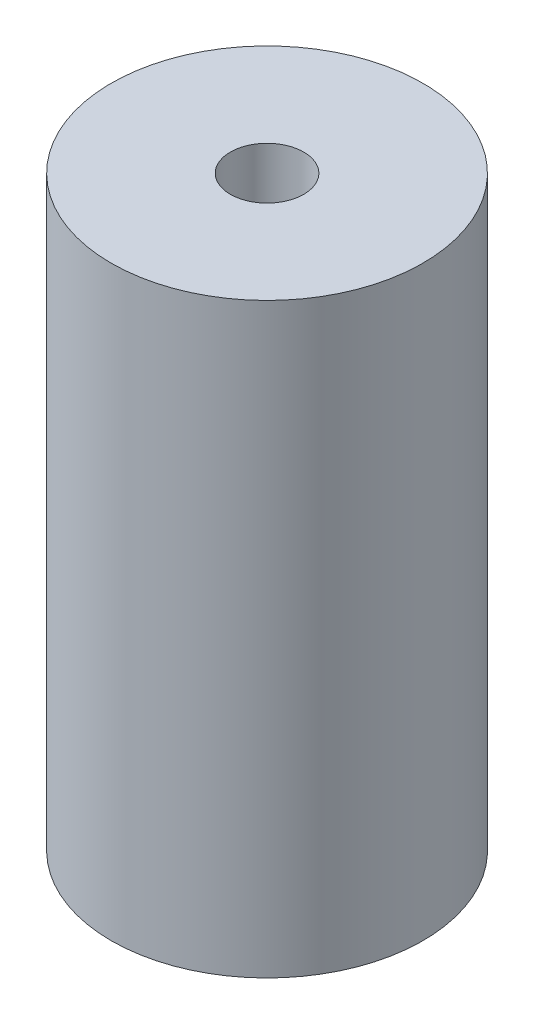
ISO-10303-21;
HEADER;
FILE_DESCRIPTION(('STEP AP214'),'2;1');
FILE_NAME('part.step','',(''),(''),'','','');
FILE_SCHEMA(('AUTOMOTIVE_DESIGN { 1 0 10303 214 1 1 1 1 }'));
ENDSEC;
DATA;
#1=APPLICATION_CONTEXT('core data for automotive mechanical design processes');
#2=APPLICATION_PROTOCOL_DEFINITION('international standard','automotive_design',2000,#1);
#3=PRODUCT_CONTEXT('',#1,'mechanical');
#4=PRODUCT('Part','Part','',(#3));
#5=PRODUCT_RELATED_PRODUCT_CATEGORY('part','',(#4));
#6=PRODUCT_DEFINITION_FORMATION('','',#4);
#7=PRODUCT_DEFINITION_CONTEXT('part definition',#1,'design');
#8=PRODUCT_DEFINITION('design','',#6,#7);
#9=PRODUCT_DEFINITION_SHAPE('','',#8);
#10=(LENGTH_UNIT() NAMED_UNIT(*) SI_UNIT(.MILLI.,.METRE.));
#11=(NAMED_UNIT(*) PLANE_ANGLE_UNIT() SI_UNIT($,.RADIAN.));
#12=(NAMED_UNIT(*) SI_UNIT($,.STERADIAN.) SOLID_ANGLE_UNIT());
#13=UNCERTAINTY_MEASURE_WITH_UNIT(LENGTH_MEASURE(1.E-05),#10,'distance_accuracy_value','');
#14=(GEOMETRIC_REPRESENTATION_CONTEXT(3) GLOBAL_UNCERTAINTY_ASSIGNED_CONTEXT((#13)) GLOBAL_UNIT_ASSIGNED_CONTEXT((#10,
#11,#12)) REPRESENTATION_CONTEXT('',''));
#15=CARTESIAN_POINT('',(0.,0.,0.));
#16=DIRECTION('',(0.,0.,1.));
#17=DIRECTION('',(1.,0.,0.));
#18=AXIS2_PLACEMENT_3D('',#15,#16,#17);
#19=CARTESIAN_POINT('',(0.,-6.35,0.));
#20=DIRECTION('',(0.,1.,0.));
#21=DIRECTION('',(0.,0.,1.));
#22=AXIS2_PLACEMENT_3D('',#19,#20,#21);
#23=CYLINDRICAL_SURFACE('',#22,26.9875);
#24=CARTESIAN_POINT('',(0.,-6.35,0.));
#25=DIRECTION('',(0.,1.,0.));
#26=DIRECTION('',(0.,0.,1.));
#27=AXIS2_PLACEMENT_3D('',#24,#25,#26);
#28=CIRCLE('',#27,26.9875);
#29=CARTESIAN_POINT('',(0.,-6.35,26.9875));
#30=VERTEX_POINT('',#29);
#31=EDGE_CURVE('E10',#30,#30,#28,.T.);
#32=ORIENTED_EDGE('',*,*,#31,.T.);
#33=EDGE_LOOP('',(#32));
#34=FACE_BOUND('',#33,.T.);
#35=CARTESIAN_POINT('',(0.,95.25,0.));
#36=DIRECTION('',(0.,1.,0.));
#37=DIRECTION('',(0.,0.,1.));
#38=AXIS2_PLACEMENT_3D('',#35,#36,#37);
#39=CIRCLE('',#38,26.9875);
#40=CARTESIAN_POINT('',(0.,95.25,26.9875));
#41=VERTEX_POINT('',#40);
#42=EDGE_CURVE('E47',#41,#41,#39,.T.);
#43=ORIENTED_EDGE('',*,*,#42,.F.);
#44=EDGE_LOOP('',(#43));
#45=FACE_BOUND('',#44,.T.);
#46=ADVANCED_FACE('F37',(#34,#45),#23,.T.);
#47=CARTESIAN_POINT('',(0.,-6.35,0.));
#48=DIRECTION('',(0.,1.,0.));
#49=DIRECTION('',(0.,0.,1.));
#50=AXIS2_PLACEMENT_3D('',#47,#48,#49);
#51=PLANE('',#50);
#52=CARTESIAN_POINT('',(0.,-6.35,0.));
#53=DIRECTION('',(0.,1.,0.));
#54=DIRECTION('',(0.,0.,1.));
#55=AXIS2_PLACEMENT_3D('',#52,#53,#54);
#56=CIRCLE('',#55,6.35);
#57=CARTESIAN_POINT('',(0.,-6.35,6.35));
#58=VERTEX_POINT('',#57);
#59=EDGE_CURVE('E43',#58,#58,#56,.T.);
#60=ORIENTED_EDGE('',*,*,#59,.T.);
#61=EDGE_LOOP('',(#60));
#62=FACE_BOUND('',#61,.T.);
#63=ORIENTED_EDGE('',*,*,#31,.F.);
#64=EDGE_LOOP('',(#63));
#65=FACE_BOUND('',#64,.T.);
#66=ADVANCED_FACE('F66',(#62,#65),#51,.F.);
#67=CARTESIAN_POINT('',(0.,-6.35,0.));
#68=DIRECTION('',(0.,1.,0.));
#69=DIRECTION('',(0.,0.,1.));
#70=AXIS2_PLACEMENT_3D('',#67,#68,#69);
#71=CYLINDRICAL_SURFACE('',#70,6.35);
#72=ORIENTED_EDGE('',*,*,#59,.F.);
#73=EDGE_LOOP('',(#72));
#74=FACE_BOUND('',#73,.T.);
#75=CARTESIAN_POINT('',(0.,95.25,0.));
#76=DIRECTION('',(0.,1.,0.));
#77=DIRECTION('',(0.,0.,1.));
#78=AXIS2_PLACEMENT_3D('',#75,#76,#77);
#79=CIRCLE('',#78,6.35);
#80=CARTESIAN_POINT('',(0.,95.25,6.35));
#81=VERTEX_POINT('',#80);
#82=EDGE_CURVE('E51',#81,#81,#79,.T.);
#83=ORIENTED_EDGE('',*,*,#82,.T.);
#84=EDGE_LOOP('',(#83));
#85=FACE_BOUND('',#84,.T.);
#86=ADVANCED_FACE('F57',(#74,#85),#71,.F.);
#87=CARTESIAN_POINT('',(0.,95.25,0.));
#88=DIRECTION('',(0.,1.,0.));
#89=DIRECTION('',(0.,0.,1.));
#90=AXIS2_PLACEMENT_3D('',#87,#88,#89);
#91=PLANE('',#90);
#92=ORIENTED_EDGE('',*,*,#42,.T.);
#93=EDGE_LOOP('',(#92));
#94=FACE_BOUND('',#93,.T.);
#95=ORIENTED_EDGE('',*,*,#82,.F.);
#96=EDGE_LOOP('',(#95));
#97=FACE_BOUND('',#96,.T.);
#98=ADVANCED_FACE('F59',(#94,#97),#91,.T.);
#99=CLOSED_SHELL('',(#46,#66,#86,#98));
#100=MANIFOLD_SOLID_BREP('B2',#99);
#101=ADVANCED_BREP_SHAPE_REPRESENTATION('',(#18,#100),#14);
#102=SHAPE_DEFINITION_REPRESENTATION(#9,#101);
ENDSEC;
END-ISO-10303-21;
